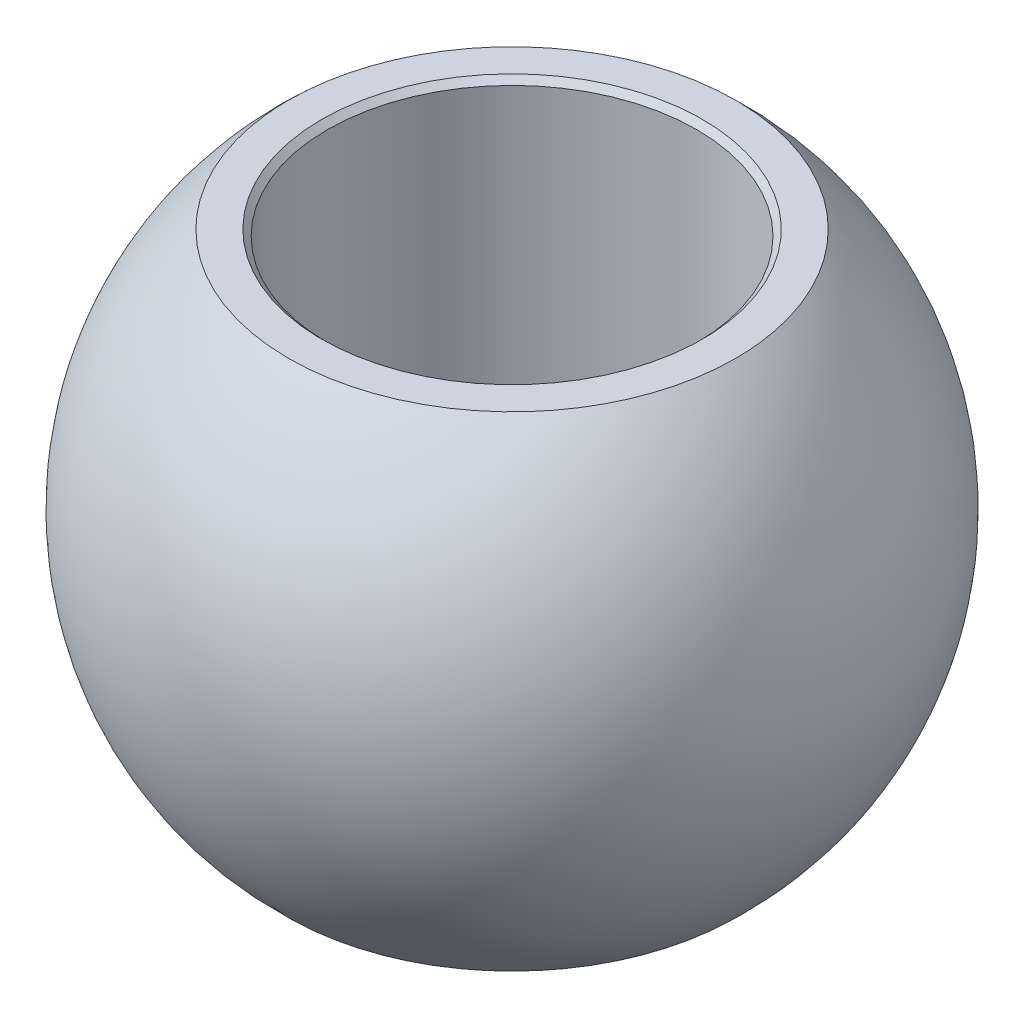
ISO-10303-21;
HEADER;
FILE_DESCRIPTION(('STEP AP214'),'2;1');
FILE_NAME('part.step','',(''),(''),'','','');
FILE_SCHEMA(('AUTOMOTIVE_DESIGN { 1 0 10303 214 1 1 1 1 }'));
ENDSEC;
DATA;
#1=APPLICATION_CONTEXT('core data for automotive mechanical design processes');
#2=APPLICATION_PROTOCOL_DEFINITION('international standard','automotive_design',2000,#1);
#3=PRODUCT_CONTEXT('',#1,'mechanical');
#4=PRODUCT('Part','Part','',(#3));
#5=PRODUCT_RELATED_PRODUCT_CATEGORY('part','',(#4));
#6=PRODUCT_DEFINITION_FORMATION('','',#4);
#7=PRODUCT_DEFINITION_CONTEXT('part definition',#1,'design');
#8=PRODUCT_DEFINITION('design','',#6,#7);
#9=PRODUCT_DEFINITION_SHAPE('','',#8);
#10=(LENGTH_UNIT() NAMED_UNIT(*) SI_UNIT(.MILLI.,.METRE.));
#11=(NAMED_UNIT(*) PLANE_ANGLE_UNIT() SI_UNIT($,.RADIAN.));
#12=(NAMED_UNIT(*) SI_UNIT($,.STERADIAN.) SOLID_ANGLE_UNIT());
#13=UNCERTAINTY_MEASURE_WITH_UNIT(LENGTH_MEASURE(1.E-05),#10,'distance_accuracy_value','');
#14=(GEOMETRIC_REPRESENTATION_CONTEXT(3) GLOBAL_UNCERTAINTY_ASSIGNED_CONTEXT((#13)) GLOBAL_UNIT_ASSIGNED_CONTEXT((#10,
#11,#12)) REPRESENTATION_CONTEXT('',''));
#15=CARTESIAN_POINT('',(0.,0.,0.));
#16=DIRECTION('',(0.,0.,1.));
#17=DIRECTION('',(1.,0.,0.));
#18=AXIS2_PLACEMENT_3D('',#15,#16,#17);
#19=CARTESIAN_POINT('',(0.,0.,66.));
#20=DIRECTION('',(0.,1.,0.));
#21=DIRECTION('',(0.,0.,1.));
#22=AXIS2_PLACEMENT_3D('',#19,#20,#21);
#23=CYLINDRICAL_SURFACE('',#22,8.);
#24=CARTESIAN_POINT('',(0.,-10.246,66.));
#25=DIRECTION('',(0.,-1.,0.));
#26=DIRECTION('',(0.,0.,-1.));
#27=AXIS2_PLACEMENT_3D('',#24,#25,#26);
#28=CIRCLE('',#27,7.99999999999999);
#29=CARTESIAN_POINT('',(0.,-10.246,58.));
#30=VERTEX_POINT('',#29);
#31=EDGE_CURVE('E55',#30,#30,#28,.T.);
#32=ORIENTED_EDGE('',*,*,#31,.T.);
#33=EDGE_LOOP('',(#32));
#34=FACE_BOUND('',#33,.T.);
#35=CARTESIAN_POINT('',(0.,10.246,66.));
#36=DIRECTION('',(0.,1.,0.));
#37=DIRECTION('',(0.,0.,-1.));
#38=AXIS2_PLACEMENT_3D('',#35,#36,#37);
#39=CIRCLE('',#38,7.99999999999999);
#40=CARTESIAN_POINT('',(0.,10.246,58.));
#41=VERTEX_POINT('',#40);
#42=EDGE_CURVE('E52',#41,#41,#39,.T.);
#43=ORIENTED_EDGE('',*,*,#42,.T.);
#44=EDGE_LOOP('',(#43));
#45=FACE_BOUND('',#44,.T.);
#46=ADVANCED_FACE('F16',(#34,#45),#23,.F.);
#47=CARTESIAN_POINT('',(0.,-10.5,66.));
#48=DIRECTION('',(0.,-1.,0.));
#49=DIRECTION('',(1.,0.,0.));
#50=AXIS2_PLACEMENT_3D('',#47,#48,#49);
#51=CONICAL_SURFACE('',#50,8.254,0.785398163397445);
#52=ORIENTED_EDGE('',*,*,#31,.F.);
#53=EDGE_LOOP('',(#52));
#54=FACE_BOUND('',#53,.T.);
#55=CARTESIAN_POINT('',(0.,-10.5,66.));
#56=DIRECTION('',(0.,-1.,0.));
#57=DIRECTION('',(1.,0.,0.));
#58=AXIS2_PLACEMENT_3D('',#55,#56,#57);
#59=CIRCLE('',#58,8.254);
#60=CARTESIAN_POINT('',(8.254,-10.5,66.));
#61=VERTEX_POINT('',#60);
#62=EDGE_CURVE('E19',#61,#61,#59,.T.);
#63=ORIENTED_EDGE('',*,*,#62,.T.);
#64=EDGE_LOOP('',(#63));
#65=FACE_BOUND('',#64,.T.);
#66=ADVANCED_FACE('F69',(#54,#65),#51,.F.);
#67=CARTESIAN_POINT('',(0.,10.5,66.));
#68=DIRECTION('',(0.,1.,0.));
#69=DIRECTION('',(-1.,0.,0.));
#70=AXIS2_PLACEMENT_3D('',#67,#68,#69);
#71=CONICAL_SURFACE('',#70,8.254,0.785398163397445);
#72=ORIENTED_EDGE('',*,*,#42,.F.);
#73=EDGE_LOOP('',(#72));
#74=FACE_BOUND('',#73,.T.);
#75=CARTESIAN_POINT('',(0.,10.5,66.));
#76=DIRECTION('',(0.,1.,0.));
#77=DIRECTION('',(-1.,0.,0.));
#78=AXIS2_PLACEMENT_3D('',#75,#76,#77);
#79=CIRCLE('',#78,8.254);
#80=CARTESIAN_POINT('',(-8.254,10.5,66.));
#81=VERTEX_POINT('',#80);
#82=EDGE_CURVE('E62',#81,#81,#79,.T.);
#83=ORIENTED_EDGE('',*,*,#82,.T.);
#84=EDGE_LOOP('',(#83));
#85=FACE_BOUND('',#84,.T.);
#86=ADVANCED_FACE('F66',(#74,#85),#71,.F.);
#87=CARTESIAN_POINT('',(0.,-10.5,66.));
#88=DIRECTION('',(0.,1.,0.));
#89=DIRECTION('',(0.,0.,1.));
#90=AXIS2_PLACEMENT_3D('',#87,#88,#89);
#91=PLANE('',#90);
#92=CARTESIAN_POINT('',(0.,-10.5,56.307007685962));
#93=CARTESIAN_POINT('',(-0.27212164117038,-10.5,56.3070091878021));
#94=CARTESIAN_POINT('',(-0.544292591809238,-10.5,56.3184766123889));
#95=CARTESIAN_POINT('',(-1.08681205096626,-10.5,56.3642798552825));
#96=CARTESIAN_POINT('',(-1.35715959487147,-10.5,56.3986269448996));
#97=CARTESIAN_POINT('',(-1.89451787181989,-10.5,56.4900414980761));
#98=CARTESIAN_POINT('',(-2.16152135144229,-10.5,56.5471516826748));
#99=CARTESIAN_POINT('',(-2.68976631223644,-10.5,56.6836872275323));
#100=CARTESIAN_POINT('',(-2.95100763455607,-10.5,56.7631132021694));
#101=CARTESIAN_POINT('',(-3.465639497278,-10.5,56.9436355930102));
#102=CARTESIAN_POINT('',(-3.71903661853773,-10.5,57.044713247888));
#103=CARTESIAN_POINT('',(-4.21642029510445,-10.5,57.267864001089));
#104=CARTESIAN_POINT('',(-4.46040656514491,-10.5,57.3899377352447));
#105=CARTESIAN_POINT('',(-4.93711090538281,-10.5,57.6541469132285));
#106=CARTESIAN_POINT('',(-5.16983430879159,-10.5,57.7962727346228));
#107=CARTESIAN_POINT('',(-5.62247905731488,-10.5,58.0996168516478));
#108=CARTESIAN_POINT('',(-5.8424006783114,-10.5,58.2608347356118));
#109=CARTESIAN_POINT('',(-6.26792791632561,-10.5,58.6012545322896));
#110=CARTESIAN_POINT('',(-6.47353060809939,-10.5,58.7804601015964));
#111=CARTESIAN_POINT('',(-6.86890955694769,-10.5,59.1555543166732));
#112=CARTESIAN_POINT('',(-7.05868578240682,-10.5,59.3514429957682));
#113=CARTESIAN_POINT('',(-7.42107777481006,-10.5,59.7585280156052));
#114=CARTESIAN_POINT('',(-7.59369207380414,-10.5,59.9697256631371));
#115=CARTESIAN_POINT('',(-7.92051441445877,-10.5,60.4059121160598));
#116=CARTESIAN_POINT('',(-8.07472246323578,-10.5,60.6309009161184));
#117=CARTESIAN_POINT('',(-8.36363052884048,-10.5,61.0930613792017));
#118=CARTESIAN_POINT('',(-8.49833127902382,-10.5,61.3302325837877));
#119=CARTESIAN_POINT('',(-8.74727400509074,-10.5,61.8150794835158));
#120=CARTESIAN_POINT('',(-8.8615159802911,-10.5,62.0627551790087));
#121=CARTESIAN_POINT('',(-9.06872783755005,-10.5,62.566847502476));
#122=CARTESIAN_POINT('',(-9.16169794747189,-10.5,62.8232640367853));
#123=CARTESIAN_POINT('',(-9.32570668654263,-10.5,63.3430176036149));
#124=CARTESIAN_POINT('',(-9.39674531586606,-10.5,63.6063546360802));
#125=CARTESIAN_POINT('',(-9.5163863778443,-10.5,64.1380784761397));
#126=CARTESIAN_POINT('',(-9.56498869043941,-10.5,64.4064653107482));
#127=CARTESIAN_POINT('',(-9.63941102514169,-10.5,64.9463793169505));
#128=CARTESIAN_POINT('',(-9.66523104711962,-10.5,65.2179064885623));
#129=CARTESIAN_POINT('',(-9.6939052354131,-10.5,65.7621707720475));
#130=CARTESIAN_POINT('',(-9.69675940172865,-10.5,66.0349078839209));
#131=CARTESIAN_POINT('',(-9.67948158718269,-10.5,66.5796530492235));
#132=CARTESIAN_POINT('',(-9.65934960645157,-10.5,66.8516611026568));
#133=CARTESIAN_POINT('',(-9.59624279351729,-10.5,67.3930128884304));
#134=CARTESIAN_POINT('',(-9.55326808354775,-10.5,67.6623566350197));
#135=CARTESIAN_POINT('',(-9.44478140889442,-10.5,68.1964664347298));
#136=CARTESIAN_POINT('',(-9.37926944403128,-10.5,68.461232487814));
#137=CARTESIAN_POINT('',(-9.22617318373443,-10.5,68.9843073958823));
#138=CARTESIAN_POINT('',(-9.13858865185683,-10.5,69.2426161816626));
#139=CARTESIAN_POINT('',(-8.94197029026527,-10.5,69.7509371599063));
#140=CARTESIAN_POINT('',(-8.8329364612676,-10.5,70.0009493526467));
#141=CARTESIAN_POINT('',(-8.59419018265318,-10.5,70.4909089208322));
#142=CARTESIAN_POINT('',(-8.46447695556921,-10.5,70.7308559174354));
#143=CARTESIAN_POINT('',(-8.18529702167023,-10.5,71.1989691821187));
#144=CARTESIAN_POINT('',(-8.03583030721786,-10.5,71.4271354456438));
#145=CARTESIAN_POINT('',(-7.71821974160969,-10.5,71.8700459311234));
#146=CARTESIAN_POINT('',(-7.55007748759099,-10.5,72.0847912983857));
#147=CARTESIAN_POINT('',(-7.1963010816095,-10.5,72.4993542464977));
#148=CARTESIAN_POINT('',(-7.01066696458878,-10.5,72.6991718571659));
#149=CARTESIAN_POINT('',(-6.62326568493819,-10.5,73.0824202319663));
#150=CARTESIAN_POINT('',(-6.42150181558207,-10.5,73.2658543250734));
#151=CARTESIAN_POINT('',(-6.00323734556509,-10.5,73.6150816934466));
#152=CARTESIAN_POINT('',(-5.78673642729281,-10.5,73.7808745883137));
#153=CARTESIAN_POINT('',(-5.34043337662244,-10.5,74.0937117739148));
#154=CARTESIAN_POINT('',(-5.11062492944105,-10.5,74.2407470558816));
#155=CARTESIAN_POINT('',(-4.63944272667882,-10.5,74.5149260342321));
#156=CARTESIAN_POINT('',(-4.39806932159665,-10.5,74.6420703329535));
#157=CARTESIAN_POINT('',(-3.90525515811103,-10.5,74.8756693226591));
#158=CARTESIAN_POINT('',(-3.65380588389799,-10.5,74.9821060476749));
#159=CARTESIAN_POINT('',(-3.14283197892517,-10.5,75.1733921215297));
#160=CARTESIAN_POINT('',(-2.88330757069514,-10.5,75.2582420646542));
#161=CARTESIAN_POINT('',(-2.35852962318956,-10.5,75.4056145320599));
#162=CARTESIAN_POINT('',(-2.09328778617771,-10.5,75.4681787787135));
#163=CARTESIAN_POINT('',(-1.55858453024704,-10.5,75.5707347571873));
#164=CARTESIAN_POINT('',(-1.28912525495624,-10.5,75.6107375965625));
#165=CARTESIAN_POINT('',(-0.849373402619261,-10.5,75.6572050665681));
#166=CARTESIAN_POINT('',(-0.679785108764279,-10.5,75.670621094733));
#167=CARTESIAN_POINT('',(-0.340137630626001,-10.5,75.6885151877997));
#168=CARTESIAN_POINT('',(-0.170078446342704,-10.5,75.6929932527015));
#169=CARTESIAN_POINT('',(0.272121641170381,-10.5,75.6929908121978));
#170=CARTESIAN_POINT('',(0.54429259180924,-10.5,75.6815233876111));
#171=CARTESIAN_POINT('',(1.08681205096627,-10.5,75.6357201447175));
#172=CARTESIAN_POINT('',(1.35715959487147,-10.5,75.6013730551004));
#173=CARTESIAN_POINT('',(1.89451787181989,-10.5,75.5099585019239));
#174=CARTESIAN_POINT('',(2.16152135144229,-10.5,75.4528483173252));
#175=CARTESIAN_POINT('',(2.68976631223644,-10.5,75.3163127724677));
#176=CARTESIAN_POINT('',(2.95100763455607,-10.5,75.2368867978306));
#177=CARTESIAN_POINT('',(3.46563949727799,-10.5,75.0563644069898));
#178=CARTESIAN_POINT('',(3.71903661853773,-10.5,74.955286752112));
#179=CARTESIAN_POINT('',(4.21642029510445,-10.5,74.732135998911));
#180=CARTESIAN_POINT('',(4.4604065651449,-10.5,74.6100622647553));
#181=CARTESIAN_POINT('',(4.93711090538282,-10.5,74.3458530867715));
#182=CARTESIAN_POINT('',(5.16983430879159,-10.5,74.2037272653772));
#183=CARTESIAN_POINT('',(5.62247905731488,-10.5,73.9003831483522));
#184=CARTESIAN_POINT('',(5.8424006783114,-10.5,73.7391652643882));
#185=CARTESIAN_POINT('',(6.2679279163256,-10.5,73.3987454677104));
#186=CARTESIAN_POINT('',(6.47353060809939,-10.5,73.2195398984036));
#187=CARTESIAN_POINT('',(6.86890955694769,-10.5,72.8444456833269));
#188=CARTESIAN_POINT('',(7.05868578240682,-10.5,72.6485570042318));
#189=CARTESIAN_POINT('',(7.42107777481006,-10.5,72.2414719843948));
#190=CARTESIAN_POINT('',(7.59369207380414,-10.5,72.0302743368629));
#191=CARTESIAN_POINT('',(7.92051441445877,-10.5,71.5940878839402));
#192=CARTESIAN_POINT('',(8.07472246323578,-10.5,71.3690990838816));
#193=CARTESIAN_POINT('',(8.36363052884048,-10.5,70.9069386207983));
#194=CARTESIAN_POINT('',(8.49833127902383,-10.5,70.6697674162123));
#195=CARTESIAN_POINT('',(8.74727400509074,-10.5,70.1849205164842));
#196=CARTESIAN_POINT('',(8.8615159802911,-10.5,69.9372448209914));
#197=CARTESIAN_POINT('',(9.06872783755004,-10.5,69.433152497524));
#198=CARTESIAN_POINT('',(9.16169794747189,-10.5,69.1767359632147));
#199=CARTESIAN_POINT('',(9.32570668654262,-10.5,68.6569823963851));
#200=CARTESIAN_POINT('',(9.39674531586606,-10.5,68.3936453639199));
#201=CARTESIAN_POINT('',(9.51638637784429,-10.5,67.8619215238603));
#202=CARTESIAN_POINT('',(9.56498869043941,-10.5,67.5935346892519));
#203=CARTESIAN_POINT('',(9.63941102514169,-10.5,67.0536206830495));
#204=CARTESIAN_POINT('',(9.66523104711961,-10.5,66.7820935114377));
#205=CARTESIAN_POINT('',(9.69390523541309,-10.5,66.2378292279526));
#206=CARTESIAN_POINT('',(9.69675940172865,-10.5,65.9650921160791));
#207=CARTESIAN_POINT('',(9.67948158718269,-10.5,65.4203469507765));
#208=CARTESIAN_POINT('',(9.65934960645157,-10.5,65.1483388973432));
#209=CARTESIAN_POINT('',(9.59624279351729,-10.5,64.6069871115697));
#210=CARTESIAN_POINT('',(9.55326808354775,-10.5,64.3376433649803));
#211=CARTESIAN_POINT('',(9.44478140889442,-10.5,63.8035335652702));
#212=CARTESIAN_POINT('',(9.37926944403128,-10.5,63.538767512186));
#213=CARTESIAN_POINT('',(9.22617318373442,-10.5,63.0156926041178));
#214=CARTESIAN_POINT('',(9.13858865185682,-10.5,62.7573838183374));
#215=CARTESIAN_POINT('',(8.94197029026527,-10.5,62.2490628400937));
#216=CARTESIAN_POINT('',(8.8329364612676,-10.5,61.9990506473534));
#217=CARTESIAN_POINT('',(8.59419018265318,-10.5,61.5090910791678));
#218=CARTESIAN_POINT('',(8.46447695556921,-10.5,61.2691440825646));
#219=CARTESIAN_POINT('',(8.18529702167023,-10.5,60.8010308178813));
#220=CARTESIAN_POINT('',(8.03583030721786,-10.5,60.5728645543562));
#221=CARTESIAN_POINT('',(7.71821974160969,-10.5,60.1299540688766));
#222=CARTESIAN_POINT('',(7.55007748759099,-10.5,59.9152087016143));
#223=CARTESIAN_POINT('',(7.1963010816095,-10.5,59.5006457535023));
#224=CARTESIAN_POINT('',(7.01066696458878,-10.5,59.3008281428342));
#225=CARTESIAN_POINT('',(6.6232656849382,-10.5,58.9175797680337));
#226=CARTESIAN_POINT('',(6.42150181558207,-10.5,58.7341456749266));
#227=CARTESIAN_POINT('',(6.0032373455651,-10.5,58.3849183065535));
#228=CARTESIAN_POINT('',(5.78673642729282,-10.5,58.2191254116864));
#229=CARTESIAN_POINT('',(5.34043337662245,-10.5,57.9062882260852));
#230=CARTESIAN_POINT('',(5.11062492944106,-10.5,57.7592529441184));
#231=CARTESIAN_POINT('',(4.63944272667883,-10.5,57.4850739657679));
#232=CARTESIAN_POINT('',(4.39806932159666,-10.5,57.3579296670465));
#233=CARTESIAN_POINT('',(3.90525515811104,-10.5,57.1243306773409));
#234=CARTESIAN_POINT('',(3.653805883898,-10.5,57.0178939523251));
#235=CARTESIAN_POINT('',(3.14283197892518,-10.5,56.8266078784703));
#236=CARTESIAN_POINT('',(2.88330757069514,-10.5,56.7417579353458));
#237=CARTESIAN_POINT('',(2.35852962318956,-10.5,56.5943854679401));
#238=CARTESIAN_POINT('',(2.09328778617772,-10.5,56.5318212212865));
#239=CARTESIAN_POINT('',(1.55858453024704,-10.5,56.4292652428127));
#240=CARTESIAN_POINT('',(1.28912525495625,-10.5,56.3892624034375));
#241=CARTESIAN_POINT('',(0.849373402619268,-10.5,56.3427949334319));
#242=CARTESIAN_POINT('',(0.679785108764284,-10.5,56.329378905267));
#243=CARTESIAN_POINT('',(0.340137630626002,-10.5,56.3114848122003));
#244=CARTESIAN_POINT('',(0.170078446342704,-10.5,56.3070067472985));
#245=CARTESIAN_POINT('',(0.,-10.5,56.307007685962));
#246=B_SPLINE_CURVE_WITH_KNOTS('',3,(#92,#93,#94,#95,#96,#97,#98,#99,#100,#101,#102,#103,#104,
#105,#106,#107,#108,#109,#110,#111,#112,#113,#114,#115,#116,#117,#118,#119,#120,#121,#122,#123,
#124,#125,#126,#127,#128,#129,#130,#131,#132,#133,#134,#135,#136,#137,#138,#139,#140,#141,#142,
#143,#144,#145,#146,#147,#148,#149,#150,#151,#152,#153,#154,#155,#156,#157,#158,#159,#160,#161,
#162,#163,#164,#165,#166,#167,#168,#169,#170,#171,#172,#173,#174,#175,#176,#177,#178,#179,#180,
#181,#182,#183,#184,#185,#186,#187,#188,#189,#190,#191,#192,#193,#194,#195,#196,#197,#198,#199,
#200,#201,#202,#203,#204,#205,#206,#207,#208,#209,#210,#211,#212,#213,#214,#215,#216,#217,#218,
#219,#220,#221,#222,#223,#224,#225,#226,#227,#228,#229,#230,#231,#232,#233,#234,#235,#236,#237,
#238,#239,#240,#241,#242,#243,#244,#245),.UNSPECIFIED.,.T.,.F.,(4,2,2,2,2,2,2,2,2,2,2,2,2,2,2,2,
2,2,2,2,2,2,2,2,2,2,2,2,2,2,2,2,2,2,2,2,2,2,2,2,2,2,2,2,2,2,2,2,2,2,2,2,2,2,2,2,2,2,2,2,2,2,2,2,
2,2,2,2,2,2,2,2,2,2,2,2,4),(0.,0.816209227116433,1.63282084464599,2.45097232370843,
3.26914632959013,4.08661422951519,4.90410688950189,5.7212085836211,6.5382926624454,
7.35554317837785,8.17279532683426,8.99011731914401,9.80743899544889,10.6247299374541,
11.4420209067525,12.2593031208573,13.0765853284577,13.893871909392,14.7111584949621,
15.5284450805322,16.3457316614665,17.1630138690669,17.9802960831717,18.7975870524701,
19.6148779944753,20.4321996707802,21.2495216630899,22.0667738115463,22.8840243274788,
23.7011084063031,24.5182101004223,25.335702760409,26.153170660334,26.9713446662157,
27.7894961452782,28.6061077628077,29.4223169899242,29.9324550173206,30.4425930447171,
31.2588022718335,32.0754138893631,32.8935653684255,33.7117393743072,34.5292072742323,
35.346699934219,36.1638016283382,36.9808857071625,37.7981362230949,38.6153883715513,
39.4327103638611,40.250032040166,41.0673229821711,41.8846139514695,42.7018961655743,
43.5191783731747,44.3364649541091,45.1537515396792,45.9710381252492,46.7883247061836,
47.6056069137839,48.4228891278887,49.2401800971872,50.0574710391923,50.8747927154972,
51.692114707807,52.5093668562634,53.3266173721958,54.1437014510201,54.9608031451393,
55.7782958051261,56.5957637050511,57.4139377109328,58.2320891899952,59.0487008075248,
59.8649100346412,60.3750480620377,60.8851860894341),.UNSPECIFIED.);
#247=CARTESIAN_POINT('',(0.,-10.5,56.307007685962));
#248=VERTEX_POINT('',#247);
#249=EDGE_CURVE('E25',#248,#248,#246,.T.);
#250=ORIENTED_EDGE('',*,*,#249,.F.);
#251=EDGE_LOOP('',(#250));
#252=FACE_BOUND('',#251,.T.);
#253=ORIENTED_EDGE('',*,*,#62,.F.);
#254=EDGE_LOOP('',(#253));
#255=FACE_BOUND('',#254,.T.);
#256=ADVANCED_FACE('F40',(#252,#255),#91,.F.);
#257=CARTESIAN_POINT('',(0.,10.5,66.));
#258=DIRECTION('',(0.,-1.,0.));
#259=DIRECTION('',(0.,0.,-1.));
#260=AXIS2_PLACEMENT_3D('',#257,#258,#259);
#261=PLANE('',#260);
#262=CARTESIAN_POINT('',(0.,10.5,75.692992314038));
#263=CARTESIAN_POINT('',(-0.272121641170377,10.5,75.6929908121979));
#264=CARTESIAN_POINT('',(-0.544292591809235,10.5,75.6815233876111));
#265=CARTESIAN_POINT('',(-1.08681205096626,10.5,75.6357201447175));
#266=CARTESIAN_POINT('',(-1.35715959487147,10.5,75.6013730551004));
#267=CARTESIAN_POINT('',(-1.89451787181988,10.5,75.5099585019239));
#268=CARTESIAN_POINT('',(-2.16152135144229,10.5,75.4528483173252));
#269=CARTESIAN_POINT('',(-2.68976631223644,10.5,75.3163127724677));
#270=CARTESIAN_POINT('',(-2.95100763455606,10.5,75.2368867978306));
#271=CARTESIAN_POINT('',(-3.46563949727799,10.5,75.0563644069898));
#272=CARTESIAN_POINT('',(-3.71903661853772,10.5,74.955286752112));
#273=CARTESIAN_POINT('',(-4.21642029510444,10.5,74.732135998911));
#274=CARTESIAN_POINT('',(-4.4604065651449,10.5,74.6100622647553));
#275=CARTESIAN_POINT('',(-4.93711090538281,10.5,74.3458530867715));
#276=CARTESIAN_POINT('',(-5.16983430879159,10.5,74.2037272653772));
#277=CARTESIAN_POINT('',(-5.62247905731487,10.5,73.9003831483522));
#278=CARTESIAN_POINT('',(-5.84240067831139,10.5,73.7391652643882));
#279=CARTESIAN_POINT('',(-6.2679279163256,10.5,73.3987454677104));
#280=CARTESIAN_POINT('',(-6.47353060809939,10.5,73.2195398984036));
#281=CARTESIAN_POINT('',(-6.86890955694769,10.5,72.8444456833269));
#282=CARTESIAN_POINT('',(-7.05868578240681,10.5,72.6485570042318));
#283=CARTESIAN_POINT('',(-7.42107777481005,10.5,72.2414719843948));
#284=CARTESIAN_POINT('',(-7.59369207380414,10.5,72.0302743368629));
#285=CARTESIAN_POINT('',(-7.92051441445877,10.5,71.5940878839403));
#286=CARTESIAN_POINT('',(-8.07472246323578,10.5,71.3690990838816));
#287=CARTESIAN_POINT('',(-8.36363052884047,10.5,70.9069386207983));
#288=CARTESIAN_POINT('',(-8.49833127902382,10.5,70.6697674162123));
#289=CARTESIAN_POINT('',(-8.74727400509074,10.5,70.1849205164842));
#290=CARTESIAN_POINT('',(-8.8615159802911,10.5,69.9372448209914));
#291=CARTESIAN_POINT('',(-9.06872783755004,10.5,69.433152497524));
#292=CARTESIAN_POINT('',(-9.16169794747189,10.5,69.1767359632147));
#293=CARTESIAN_POINT('',(-9.32570668654263,10.5,68.6569823963851));
#294=CARTESIAN_POINT('',(-9.39674531586606,10.5,68.3936453639199));
#295=CARTESIAN_POINT('',(-9.51638637784429,10.5,67.8619215238603));
#296=CARTESIAN_POINT('',(-9.56498869043941,10.5,67.5935346892519));
#297=CARTESIAN_POINT('',(-9.63941102514169,10.5,67.0536206830495));
#298=CARTESIAN_POINT('',(-9.66523104711962,10.5,66.7820935114377));
#299=CARTESIAN_POINT('',(-9.6939052354131,10.5,66.2378292279525));
#300=CARTESIAN_POINT('',(-9.69675940172865,10.5,65.9650921160791));
#301=CARTESIAN_POINT('',(-9.67948158718269,10.5,65.4203469507765));
#302=CARTESIAN_POINT('',(-9.65934960645157,10.5,65.1483388973432));
#303=CARTESIAN_POINT('',(-9.59624279351729,10.5,64.6069871115697));
#304=CARTESIAN_POINT('',(-9.55326808354775,10.5,64.3376433649803));
#305=CARTESIAN_POINT('',(-9.44478140889442,10.5,63.8035335652702));
#306=CARTESIAN_POINT('',(-9.37926944403128,10.5,63.538767512186));
#307=CARTESIAN_POINT('',(-9.22617318373442,10.5,63.0156926041177));
#308=CARTESIAN_POINT('',(-9.13858865185682,10.5,62.7573838183374));
#309=CARTESIAN_POINT('',(-8.94197029026526,10.5,62.2490628400937));
#310=CARTESIAN_POINT('',(-8.8329364612676,10.5,61.9990506473533));
#311=CARTESIAN_POINT('',(-8.59419018265317,10.5,61.5090910791678));
#312=CARTESIAN_POINT('',(-8.46447695556921,10.5,61.2691440825646));
#313=CARTESIAN_POINT('',(-8.18529702167022,10.5,60.8010308178813));
#314=CARTESIAN_POINT('',(-8.03583030721785,10.5,60.5728645543562));
#315=CARTESIAN_POINT('',(-7.71821974160967,10.5,60.1299540688766));
#316=CARTESIAN_POINT('',(-7.55007748759098,10.5,59.9152087016143));
#317=CARTESIAN_POINT('',(-7.19630108160949,10.5,59.5006457535023));
#318=CARTESIAN_POINT('',(-7.01066696458878,10.5,59.3008281428342));
#319=CARTESIAN_POINT('',(-6.62326568493819,10.5,58.9175797680337));
#320=CARTESIAN_POINT('',(-6.42150181558207,10.5,58.7341456749266));
#321=CARTESIAN_POINT('',(-6.00323734556509,10.5,58.3849183065535));
#322=CARTESIAN_POINT('',(-5.78673642729282,10.5,58.2191254116863));
#323=CARTESIAN_POINT('',(-5.34043337662245,10.5,57.9062882260852));
#324=CARTESIAN_POINT('',(-5.11062492944106,10.5,57.7592529441184));
#325=CARTESIAN_POINT('',(-4.63944272667883,10.5,57.4850739657679));
#326=CARTESIAN_POINT('',(-4.39806932159666,10.5,57.3579296670465));
#327=CARTESIAN_POINT('',(-3.90525515811103,10.5,57.1243306773409));
#328=CARTESIAN_POINT('',(-3.65380588389799,10.5,57.0178939523251));
#329=CARTESIAN_POINT('',(-3.14283197892517,10.5,56.8266078784703));
#330=CARTESIAN_POINT('',(-2.88330757069514,10.5,56.7417579353458));
#331=CARTESIAN_POINT('',(-2.35852962318956,10.5,56.5943854679401));
#332=CARTESIAN_POINT('',(-2.09328778617771,10.5,56.5318212212865));
#333=CARTESIAN_POINT('',(-1.55858453024704,10.5,56.4292652428127));
#334=CARTESIAN_POINT('',(-1.28912525495625,10.5,56.3892624034375));
#335=CARTESIAN_POINT('',(-0.849373402619264,10.5,56.3427949334319));
#336=CARTESIAN_POINT('',(-0.679785108764281,10.5,56.329378905267));
#337=CARTESIAN_POINT('',(-0.340137630626001,10.5,56.3114848122003));
#338=CARTESIAN_POINT('',(-0.170078446342704,10.5,56.3070067472985));
#339=CARTESIAN_POINT('',(0.272121641170379,10.5,56.3070091878021));
#340=CARTESIAN_POINT('',(0.544292591809236,10.5,56.3184766123889));
#341=CARTESIAN_POINT('',(1.08681205096626,10.5,56.3642798552825));
#342=CARTESIAN_POINT('',(1.35715959487147,10.5,56.3986269448996));
#343=CARTESIAN_POINT('',(1.89451787181989,10.5,56.4900414980761));
#344=CARTESIAN_POINT('',(2.16152135144228,10.5,56.5471516826748));
#345=CARTESIAN_POINT('',(2.68976631223644,10.5,56.6836872275323));
#346=CARTESIAN_POINT('',(2.95100763455606,10.5,56.7631132021694));
#347=CARTESIAN_POINT('',(3.46563949727799,10.5,56.9436355930102));
#348=CARTESIAN_POINT('',(3.71903661853772,10.5,57.044713247888));
#349=CARTESIAN_POINT('',(4.21642029510444,10.5,57.267864001089));
#350=CARTESIAN_POINT('',(4.4604065651449,10.5,57.3899377352447));
#351=CARTESIAN_POINT('',(4.93711090538281,10.5,57.6541469132285));
#352=CARTESIAN_POINT('',(5.16983430879159,10.5,57.7962727346228));
#353=CARTESIAN_POINT('',(5.62247905731488,10.5,58.0996168516478));
#354=CARTESIAN_POINT('',(5.84240067831139,10.5,58.2608347356118));
#355=CARTESIAN_POINT('',(6.2679279163256,10.5,58.6012545322896));
#356=CARTESIAN_POINT('',(6.47353060809939,10.5,58.7804601015964));
#357=CARTESIAN_POINT('',(6.86890955694769,10.5,59.1555543166732));
#358=CARTESIAN_POINT('',(7.05868578240681,10.5,59.3514429957682));
#359=CARTESIAN_POINT('',(7.42107777481005,10.5,59.7585280156052));
#360=CARTESIAN_POINT('',(7.59369207380414,10.5,59.9697256631371));
#361=CARTESIAN_POINT('',(7.92051441445877,10.5,60.4059121160598));
#362=CARTESIAN_POINT('',(8.07472246323578,10.5,60.6309009161184));
#363=CARTESIAN_POINT('',(8.36363052884048,10.5,61.0930613792017));
#364=CARTESIAN_POINT('',(8.49833127902383,10.5,61.3302325837877));
#365=CARTESIAN_POINT('',(8.74727400509074,10.5,61.8150794835158));
#366=CARTESIAN_POINT('',(8.8615159802911,10.5,62.0627551790086));
#367=CARTESIAN_POINT('',(9.06872783755004,10.5,62.566847502476));
#368=CARTESIAN_POINT('',(9.16169794747189,10.5,62.8232640367853));
#369=CARTESIAN_POINT('',(9.32570668654262,10.5,63.3430176036149));
#370=CARTESIAN_POINT('',(9.39674531586606,10.5,63.6063546360801));
#371=CARTESIAN_POINT('',(9.51638637784429,10.5,64.1380784761397));
#372=CARTESIAN_POINT('',(9.56498869043941,10.5,64.4064653107481));
#373=CARTESIAN_POINT('',(9.63941102514169,10.5,64.9463793169505));
#374=CARTESIAN_POINT('',(9.66523104711962,10.5,65.2179064885623));
#375=CARTESIAN_POINT('',(9.6939052354131,10.5,65.7621707720475));
#376=CARTESIAN_POINT('',(9.69675940172865,10.5,66.0349078839209));
#377=CARTESIAN_POINT('',(9.67948158718269,10.5,66.5796530492235));
#378=CARTESIAN_POINT('',(9.65934960645157,10.5,66.8516611026568));
#379=CARTESIAN_POINT('',(9.59624279351729,10.5,67.3930128884303));
#380=CARTESIAN_POINT('',(9.55326808354775,10.5,67.6623566350197));
#381=CARTESIAN_POINT('',(9.44478140889442,10.5,68.1964664347298));
#382=CARTESIAN_POINT('',(9.37926944403128,10.5,68.461232487814));
#383=CARTESIAN_POINT('',(9.22617318373443,10.5,68.9843073958823));
#384=CARTESIAN_POINT('',(9.13858865185683,10.5,69.2426161816626));
#385=CARTESIAN_POINT('',(8.94197029026527,10.5,69.7509371599063));
#386=CARTESIAN_POINT('',(8.83293646126761,10.5,70.0009493526467));
#387=CARTESIAN_POINT('',(8.59419018265318,10.5,70.4909089208322));
#388=CARTESIAN_POINT('',(8.46447695556921,10.5,70.7308559174354));
#389=CARTESIAN_POINT('',(8.18529702167023,10.5,71.1989691821187));
#390=CARTESIAN_POINT('',(8.03583030721786,10.5,71.4271354456438));
#391=CARTESIAN_POINT('',(7.71821974160968,10.5,71.8700459311234));
#392=CARTESIAN_POINT('',(7.55007748759099,10.5,72.0847912983857));
#393=CARTESIAN_POINT('',(7.1963010816095,10.5,72.4993542464977));
#394=CARTESIAN_POINT('',(7.01066696458878,10.5,72.6991718571659));
#395=CARTESIAN_POINT('',(6.6232656849382,10.5,73.0824202319663));
#396=CARTESIAN_POINT('',(6.42150181558207,10.5,73.2658543250734));
#397=CARTESIAN_POINT('',(6.0032373455651,10.5,73.6150816934466));
#398=CARTESIAN_POINT('',(5.78673642729281,10.5,73.7808745883137));
#399=CARTESIAN_POINT('',(5.34043337662244,10.5,74.0937117739148));
#400=CARTESIAN_POINT('',(5.11062492944105,10.5,74.2407470558816));
#401=CARTESIAN_POINT('',(4.63944272667882,10.5,74.5149260342321));
#402=CARTESIAN_POINT('',(4.39806932159665,10.5,74.6420703329535));
#403=CARTESIAN_POINT('',(3.90525515811103,10.5,74.8756693226591));
#404=CARTESIAN_POINT('',(3.65380588389799,10.5,74.9821060476749));
#405=CARTESIAN_POINT('',(3.14283197892517,10.5,75.1733921215297));
#406=CARTESIAN_POINT('',(2.88330757069514,10.5,75.2582420646542));
#407=CARTESIAN_POINT('',(2.35852962318956,10.5,75.4056145320599));
#408=CARTESIAN_POINT('',(2.09328778617771,10.5,75.4681787787135));
#409=CARTESIAN_POINT('',(1.55858453024704,10.5,75.5707347571873));
#410=CARTESIAN_POINT('',(1.28912525495625,10.5,75.6107375965625));
#411=CARTESIAN_POINT('',(0.849373402619265,10.5,75.6572050665681));
#412=CARTESIAN_POINT('',(0.679785108764283,10.5,75.670621094733));
#413=CARTESIAN_POINT('',(0.340137630626003,10.5,75.6885151877997));
#414=CARTESIAN_POINT('',(0.170078446342706,10.5,75.6929932527015));
#415=CARTESIAN_POINT('',(0.,10.5,75.692992314038));
#416=B_SPLINE_CURVE_WITH_KNOTS('',3,(#262,#263,#264,#265,#266,#267,#268,#269,#270,#271,#272,
#273,#274,#275,#276,#277,#278,#279,#280,#281,#282,#283,#284,#285,#286,#287,#288,#289,#290,#291,
#292,#293,#294,#295,#296,#297,#298,#299,#300,#301,#302,#303,#304,#305,#306,#307,#308,#309,#310,
#311,#312,#313,#314,#315,#316,#317,#318,#319,#320,#321,#322,#323,#324,#325,#326,#327,#328,#329,
#330,#331,#332,#333,#334,#335,#336,#337,#338,#339,#340,#341,#342,#343,#344,#345,#346,#347,#348,
#349,#350,#351,#352,#353,#354,#355,#356,#357,#358,#359,#360,#361,#362,#363,#364,#365,#366,#367,
#368,#369,#370,#371,#372,#373,#374,#375,#376,#377,#378,#379,#380,#381,#382,#383,#384,#385,#386,
#387,#388,#389,#390,#391,#392,#393,#394,#395,#396,#397,#398,#399,#400,#401,#402,#403,#404,#405,
#406,#407,#408,#409,#410,#411,#412,#413,#414,#415),.UNSPECIFIED.,.T.,.F.,(4,2,2,2,2,2,2,2,2,2,2,
2,2,2,2,2,2,2,2,2,2,2,2,2,2,2,2,2,2,2,2,2,2,2,2,2,2,2,2,2,2,2,2,2,2,2,2,2,2,2,2,2,2,2,2,2,2,2,2,
2,2,2,2,2,2,2,2,2,2,2,2,2,2,2,2,2,4),(0.,0.816209227116433,1.63282084464599,2.45097232370843,
3.26914632959013,4.08661422951518,4.90410688950189,5.72120858362111,6.5382926624454,
7.35554317837785,8.17279532683425,8.990117319144,9.80743899544887,10.624729937454,
11.4420209067525,12.2593031208573,13.0765853284577,13.893871909392,14.7111584949621,
15.5284450805322,16.3457316614665,17.1630138690669,17.9802960831717,18.7975870524701,
19.6148779944753,20.4321996707802,21.2495216630899,22.0667738115463,22.8840243274788,
23.7011084063031,24.5182101004223,25.335702760409,26.153170660334,26.9713446662157,
27.7894961452782,28.6061077628077,29.4223169899242,29.9324550173206,30.4425930447171,
31.2588022718335,32.0754138893631,32.8935653684255,33.7117393743072,34.5292072742322,
35.3466999342189,36.1638016283382,36.9808857071625,37.7981362230949,38.6153883715513,
39.4327103638611,40.2500320401659,41.0673229821711,41.8846139514695,42.7018961655743,
43.5191783731747,44.336464954109,45.1537515396791,45.9710381252492,46.7883247061835,
47.6056069137839,48.4228891278887,49.2401800971871,50.0574710391923,50.8747927154972,
51.6921147078069,52.5093668562634,53.3266173721958,54.1437014510201,54.9608031451393,
55.778295805126,56.5957637050511,57.4139377109328,58.2320891899952,59.0487008075248,
59.8649100346412,60.3750480620377,60.8851860894341),.UNSPECIFIED.);
#417=CARTESIAN_POINT('',(0.,10.5,75.692992314038));
#418=VERTEX_POINT('',#417);
#419=EDGE_CURVE('E10',#418,#418,#416,.T.);
#420=ORIENTED_EDGE('',*,*,#419,.F.);
#421=EDGE_LOOP('',(#420));
#422=FACE_BOUND('',#421,.T.);
#423=ORIENTED_EDGE('',*,*,#82,.F.);
#424=EDGE_LOOP('',(#423));
#425=FACE_BOUND('',#424,.T.);
#426=ADVANCED_FACE('F33',(#422,#425),#261,.F.);
#427=CARTESIAN_POINT('',(0.,0.,66.));
#428=DIRECTION('',(1.,0.,0.));
#429=DIRECTION('',(0.,1.,0.));
#430=AXIS2_PLACEMENT_3D('',#427,#428,#429);
#431=SPHERICAL_SURFACE('',#430,14.29);
#432=ORIENTED_EDGE('',*,*,#249,.T.);
#433=EDGE_LOOP('',(#432));
#434=FACE_BOUND('',#433,.T.);
#435=ORIENTED_EDGE('',*,*,#419,.T.);
#436=EDGE_LOOP('',(#435));
#437=FACE_BOUND('',#436,.T.);
#438=CARTESIAN_POINT('',(-14.29,0.,66.));
#439=VERTEX_POINT('',#438);
#440=VERTEX_LOOP('',#439);
#441=FACE_BOUND('',#440,.T.);
#442=CARTESIAN_POINT('',(14.29,0.,66.));
#443=VERTEX_POINT('',#442);
#444=VERTEX_LOOP('',#443);
#445=FACE_BOUND('',#444,.T.);
#446=ADVANCED_FACE('F31',(#434,#437,#441,#445),#431,.T.);
#447=CLOSED_SHELL('',(#46,#66,#86,#256,#426,#446));
#448=MANIFOLD_SOLID_BREP('B1',#447);
#449=ADVANCED_BREP_SHAPE_REPRESENTATION('',(#18,#448),#14);
#450=SHAPE_DEFINITION_REPRESENTATION(#9,#449);
ENDSEC;
END-ISO-10303-21;
